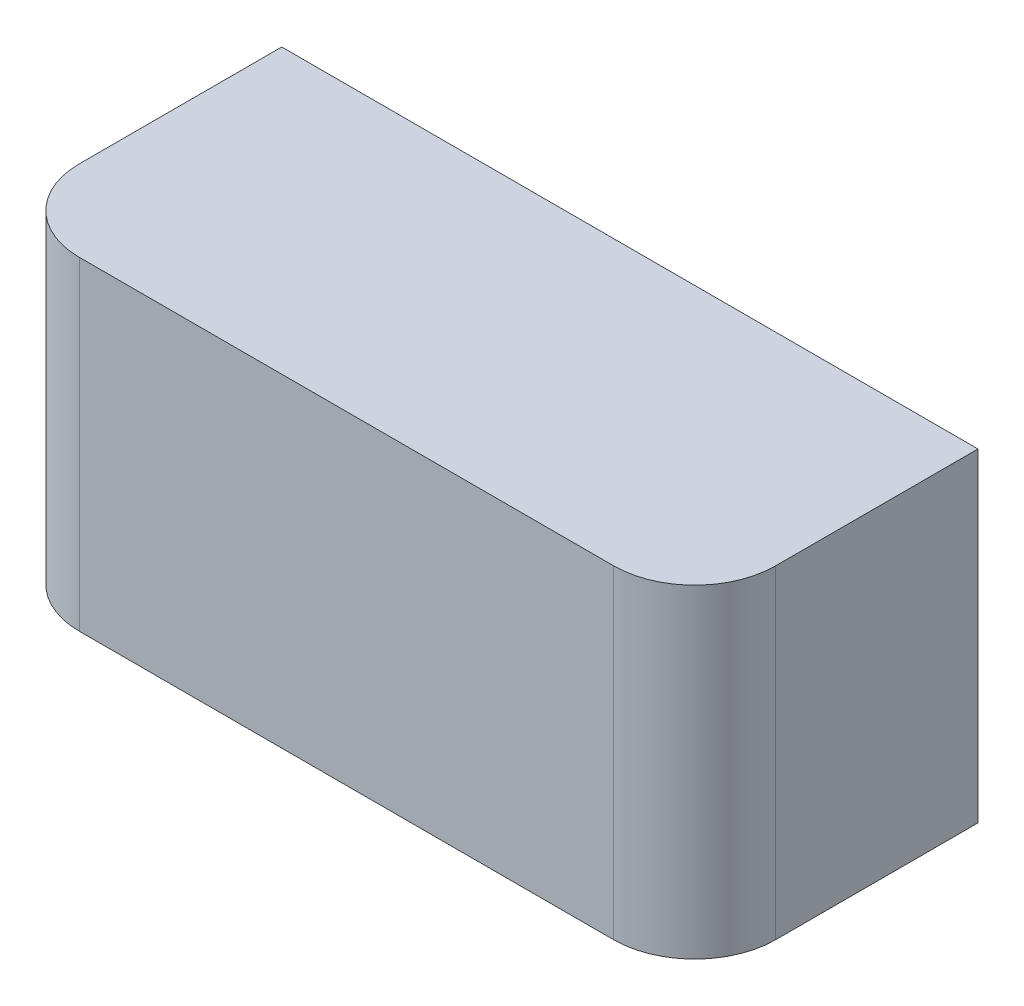
ISO-10303-21;
HEADER;
FILE_DESCRIPTION(('STEP AP214'),'2;1');
FILE_NAME('part.step','',(''),(''),'','','');
FILE_SCHEMA(('AUTOMOTIVE_DESIGN { 1 0 10303 214 1 1 1 1 }'));
ENDSEC;
DATA;
#1=APPLICATION_CONTEXT('core data for automotive mechanical design processes');
#2=APPLICATION_PROTOCOL_DEFINITION('international standard','automotive_design',2000,#1);
#3=PRODUCT_CONTEXT('',#1,'mechanical');
#4=PRODUCT('Part','Part','',(#3));
#5=PRODUCT_RELATED_PRODUCT_CATEGORY('part','',(#4));
#6=PRODUCT_DEFINITION_FORMATION('','',#4);
#7=PRODUCT_DEFINITION_CONTEXT('part definition',#1,'design');
#8=PRODUCT_DEFINITION('design','',#6,#7);
#9=PRODUCT_DEFINITION_SHAPE('','',#8);
#10=(LENGTH_UNIT() NAMED_UNIT(*) SI_UNIT(.MILLI.,.METRE.));
#11=(NAMED_UNIT(*) PLANE_ANGLE_UNIT() SI_UNIT($,.RADIAN.));
#12=(NAMED_UNIT(*) SI_UNIT($,.STERADIAN.) SOLID_ANGLE_UNIT());
#13=UNCERTAINTY_MEASURE_WITH_UNIT(LENGTH_MEASURE(1.E-05),#10,'distance_accuracy_value','');
#14=(GEOMETRIC_REPRESENTATION_CONTEXT(3) GLOBAL_UNCERTAINTY_ASSIGNED_CONTEXT((#13)) GLOBAL_UNIT_ASSIGNED_CONTEXT((#10,
#11,#12)) REPRESENTATION_CONTEXT('',''));
#15=CARTESIAN_POINT('',(0.,0.,0.));
#16=DIRECTION('',(0.,0.,1.));
#17=DIRECTION('',(1.,0.,0.));
#18=AXIS2_PLACEMENT_3D('',#15,#16,#17);
#19=CARTESIAN_POINT('',(-2.28,0.,-2.875));
#20=DIRECTION('',(0.,1.,0.));
#21=DIRECTION('',(0.,0.,1.));
#22=AXIS2_PLACEMENT_3D('',#19,#20,#21);
#23=CYLINDRICAL_SURFACE('',#22,0.05);
#24=DIRECTION('',(0.,1.,0.));
#25=VECTOR('',#24,1.);
#26=CARTESIAN_POINT('',(-2.33,0.,-2.875));
#27=LINE('',#26,#25);
#28=CARTESIAN_POINT('',(-2.33,0.,-2.875));
#29=VERTEX_POINT('',#28);
#30=CARTESIAN_POINT('',(-2.33,0.2,-2.875));
#31=VERTEX_POINT('',#30);
#32=EDGE_CURVE('E67',#29,#31,#27,.T.);
#33=ORIENTED_EDGE('',*,*,#32,.F.);
#34=CARTESIAN_POINT('',(-2.28,0.,-2.875));
#35=DIRECTION('',(0.,1.,0.));
#36=DIRECTION('',(0.,0.,1.));
#37=AXIS2_PLACEMENT_3D('',#34,#35,#36);
#38=CIRCLE('',#37,0.05);
#39=CARTESIAN_POINT('',(-2.28,0.,-2.825));
#40=VERTEX_POINT('',#39);
#41=EDGE_CURVE('E77',#29,#40,#38,.T.);
#42=ORIENTED_EDGE('',*,*,#41,.T.);
#43=DIRECTION('',(0.,1.,0.));
#44=VECTOR('',#43,1.);
#45=CARTESIAN_POINT('',(-2.28,0.,-2.825));
#46=LINE('',#45,#44);
#47=CARTESIAN_POINT('',(-2.28,0.2,-2.825));
#48=VERTEX_POINT('',#47);
#49=EDGE_CURVE('E72',#48,#40,#46,.F.);
#50=ORIENTED_EDGE('',*,*,#49,.F.);
#51=CARTESIAN_POINT('',(-2.28,0.2,-2.875));
#52=DIRECTION('',(0.,1.,0.));
#53=DIRECTION('',(0.,0.,1.));
#54=AXIS2_PLACEMENT_3D('',#51,#52,#53);
#55=CIRCLE('',#54,0.05);
#56=EDGE_CURVE('E20',#31,#48,#55,.T.);
#57=ORIENTED_EDGE('',*,*,#56,.F.);
#58=EDGE_LOOP('',(#33,#42,#50,#57));
#59=FACE_BOUND('',#58,.T.);
#60=ADVANCED_FACE('F17',(#59),#23,.T.);
#61=CARTESIAN_POINT('',(-2.28,0.,-2.825));
#62=DIRECTION('',(0.,0.,1.));
#63=DIRECTION('',(1.,0.,0.));
#64=AXIS2_PLACEMENT_3D('',#61,#62,#63);
#65=PLANE('',#64);
#66=ORIENTED_EDGE('',*,*,#49,.T.);
#67=DIRECTION('',(1.,0.,0.));
#68=VECTOR('',#67,1.);
#69=CARTESIAN_POINT('',(0.,0.,-2.825));
#70=LINE('',#69,#68);
#71=CARTESIAN_POINT('',(-1.95,0.,-2.825));
#72=VERTEX_POINT('',#71);
#73=EDGE_CURVE('E126',#40,#72,#70,.T.);
#74=ORIENTED_EDGE('',*,*,#73,.T.);
#75=DIRECTION('',(0.,1.,0.));
#76=VECTOR('',#75,1.);
#77=CARTESIAN_POINT('',(-1.95,0.,-2.825));
#78=LINE('',#77,#76);
#79=CARTESIAN_POINT('',(-1.95,0.2,-2.825));
#80=VERTEX_POINT('',#79);
#81=EDGE_CURVE('E80',#80,#72,#78,.F.);
#82=ORIENTED_EDGE('',*,*,#81,.F.);
#83=DIRECTION('',(1.,0.,0.));
#84=VECTOR('',#83,1.);
#85=CARTESIAN_POINT('',(0.,0.2,-2.825));
#86=LINE('',#85,#84);
#87=EDGE_CURVE('E83',#48,#80,#86,.T.);
#88=ORIENTED_EDGE('',*,*,#87,.F.);
#89=EDGE_LOOP('',(#66,#74,#82,#88));
#90=FACE_BOUND('',#89,.T.);
#91=ADVANCED_FACE('F84',(#90),#65,.T.);
#92=CARTESIAN_POINT('',(-1.95,0.,-2.875));
#93=DIRECTION('',(0.,1.,0.));
#94=DIRECTION('',(0.,0.,1.));
#95=AXIS2_PLACEMENT_3D('',#92,#93,#94);
#96=CYLINDRICAL_SURFACE('',#95,0.05);
#97=ORIENTED_EDGE('',*,*,#81,.T.);
#98=CARTESIAN_POINT('',(-1.95,0.,-2.875));
#99=DIRECTION('',(0.,1.,0.));
#100=DIRECTION('',(0.,0.,1.));
#101=AXIS2_PLACEMENT_3D('',#98,#99,#100);
#102=CIRCLE('',#101,0.05);
#103=CARTESIAN_POINT('',(-1.9,0.,-2.875));
#104=VERTEX_POINT('',#103);
#105=EDGE_CURVE('E124',#72,#104,#102,.T.);
#106=ORIENTED_EDGE('',*,*,#105,.T.);
#107=DIRECTION('',(0.,1.,0.));
#108=VECTOR('',#107,1.);
#109=CARTESIAN_POINT('',(-1.9,0.,-2.875));
#110=LINE('',#109,#108);
#111=CARTESIAN_POINT('',(-1.9,0.2,-2.875));
#112=VERTEX_POINT('',#111);
#113=EDGE_CURVE('E99',#112,#104,#110,.F.);
#114=ORIENTED_EDGE('',*,*,#113,.F.);
#115=CARTESIAN_POINT('',(-1.95,0.2,-2.875));
#116=DIRECTION('',(0.,1.,0.));
#117=DIRECTION('',(0.,0.,1.));
#118=AXIS2_PLACEMENT_3D('',#115,#116,#117);
#119=CIRCLE('',#118,0.05);
#120=EDGE_CURVE('E88',#80,#112,#119,.T.);
#121=ORIENTED_EDGE('',*,*,#120,.F.);
#122=EDGE_LOOP('',(#97,#106,#114,#121));
#123=FACE_BOUND('',#122,.T.);
#124=ADVANCED_FACE('F129',(#123),#96,.T.);
#125=CARTESIAN_POINT('',(-2.33,0.,-3.));
#126=DIRECTION('',(-1.,0.,0.));
#127=DIRECTION('',(0.,0.,1.));
#128=AXIS2_PLACEMENT_3D('',#125,#126,#127);
#129=PLANE('',#128);
#130=DIRECTION('',(0.,1.,0.));
#131=VECTOR('',#130,1.);
#132=CARTESIAN_POINT('',(-2.33,0.,-3.));
#133=LINE('',#132,#131);
#134=CARTESIAN_POINT('',(-2.33,0.,-3.));
#135=VERTEX_POINT('',#134);
#136=CARTESIAN_POINT('',(-2.33,0.2,-3.));
#137=VERTEX_POINT('',#136);
#138=EDGE_CURVE('E111',#135,#137,#133,.T.);
#139=ORIENTED_EDGE('',*,*,#138,.F.);
#140=DIRECTION('',(0.,0.,1.));
#141=VECTOR('',#140,1.);
#142=CARTESIAN_POINT('',(-2.33,0.,0.));
#143=LINE('',#142,#141);
#144=EDGE_CURVE('E100',#135,#29,#143,.T.);
#145=ORIENTED_EDGE('',*,*,#144,.T.);
#146=ORIENTED_EDGE('',*,*,#32,.T.);
#147=DIRECTION('',(0.,0.,1.));
#148=VECTOR('',#147,1.);
#149=CARTESIAN_POINT('',(-2.33,0.2,0.));
#150=LINE('',#149,#148);
#151=EDGE_CURVE('E92',#137,#31,#150,.T.);
#152=ORIENTED_EDGE('',*,*,#151,.F.);
#153=EDGE_LOOP('',(#139,#145,#146,#152));
#154=FACE_BOUND('',#153,.T.);
#155=ADVANCED_FACE('F135',(#154),#129,.T.);
#156=CARTESIAN_POINT('',(0.,0.2,0.));
#157=DIRECTION('',(0.,1.,0.));
#158=DIRECTION('',(0.,0.,1.));
#159=AXIS2_PLACEMENT_3D('',#156,#157,#158);
#160=PLANE('',#159);
#161=DIRECTION('',(0.,0.,-1.));
#162=VECTOR('',#161,1.);
#163=CARTESIAN_POINT('',(-1.9,0.2,-2.875));
#164=LINE('',#163,#162);
#165=CARTESIAN_POINT('',(-1.9,0.2,-3.));
#166=VERTEX_POINT('',#165);
#167=EDGE_CURVE('E101',#166,#112,#164,.F.);
#168=ORIENTED_EDGE('',*,*,#167,.F.);
#169=DIRECTION('',(-1.,0.,0.));
#170=VECTOR('',#169,1.);
#171=CARTESIAN_POINT('',(-1.9,0.2,-3.));
#172=LINE('',#171,#170);
#173=EDGE_CURVE('E107',#137,#166,#172,.F.);
#174=ORIENTED_EDGE('',*,*,#173,.F.);
#175=ORIENTED_EDGE('',*,*,#151,.T.);
#176=ORIENTED_EDGE('',*,*,#56,.T.);
#177=ORIENTED_EDGE('',*,*,#87,.T.);
#178=ORIENTED_EDGE('',*,*,#120,.T.);
#179=EDGE_LOOP('',(#168,#174,#175,#176,#177,#178));
#180=FACE_BOUND('',#179,.T.);
#181=ADVANCED_FACE('F90',(#180),#160,.T.);
#182=CARTESIAN_POINT('',(-1.9,0.,-2.875));
#183=DIRECTION('',(1.,0.,0.));
#184=DIRECTION('',(0.,0.,-1.));
#185=AXIS2_PLACEMENT_3D('',#182,#183,#184);
#186=PLANE('',#185);
#187=ORIENTED_EDGE('',*,*,#113,.T.);
#188=DIRECTION('',(0.,0.,1.));
#189=VECTOR('',#188,1.);
#190=CARTESIAN_POINT('',(-1.9,0.,0.));
#191=LINE('',#190,#189);
#192=CARTESIAN_POINT('',(-1.9,0.,-3.));
#193=VERTEX_POINT('',#192);
#194=EDGE_CURVE('E35',#104,#193,#191,.F.);
#195=ORIENTED_EDGE('',*,*,#194,.T.);
#196=DIRECTION('',(0.,1.,0.));
#197=VECTOR('',#196,1.);
#198=CARTESIAN_POINT('',(-1.9,0.,-3.));
#199=LINE('',#198,#197);
#200=EDGE_CURVE('E26',#166,#193,#199,.F.);
#201=ORIENTED_EDGE('',*,*,#200,.F.);
#202=ORIENTED_EDGE('',*,*,#167,.T.);
#203=EDGE_LOOP('',(#187,#195,#201,#202));
#204=FACE_BOUND('',#203,.T.);
#205=ADVANCED_FACE('F131',(#204),#186,.T.);
#206=CARTESIAN_POINT('',(0.,0.,0.));
#207=DIRECTION('',(0.,1.,0.));
#208=DIRECTION('',(0.,0.,1.));
#209=AXIS2_PLACEMENT_3D('',#206,#207,#208);
#210=PLANE('',#209);
#211=ORIENTED_EDGE('',*,*,#105,.F.);
#212=ORIENTED_EDGE('',*,*,#73,.F.);
#213=ORIENTED_EDGE('',*,*,#41,.F.);
#214=ORIENTED_EDGE('',*,*,#144,.F.);
#215=DIRECTION('',(-1.,0.,0.));
#216=VECTOR('',#215,1.);
#217=CARTESIAN_POINT('',(-1.9,0.,-3.));
#218=LINE('',#217,#216);
#219=EDGE_CURVE('E11',#193,#135,#218,.T.);
#220=ORIENTED_EDGE('',*,*,#219,.F.);
#221=ORIENTED_EDGE('',*,*,#194,.F.);
#222=EDGE_LOOP('',(#211,#212,#213,#214,#220,#221));
#223=FACE_BOUND('',#222,.T.);
#224=ADVANCED_FACE('F137',(#223),#210,.F.);
#225=CARTESIAN_POINT('',(-1.9,0.,-3.));
#226=DIRECTION('',(0.,0.,-1.));
#227=DIRECTION('',(-1.,0.,0.));
#228=AXIS2_PLACEMENT_3D('',#225,#226,#227);
#229=PLANE('',#228);
#230=ORIENTED_EDGE('',*,*,#200,.T.);
#231=ORIENTED_EDGE('',*,*,#219,.T.);
#232=ORIENTED_EDGE('',*,*,#138,.T.);
#233=ORIENTED_EDGE('',*,*,#173,.T.);
#234=EDGE_LOOP('',(#230,#231,#232,#233));
#235=FACE_BOUND('',#234,.T.);
#236=ADVANCED_FACE('F133',(#235),#229,.T.);
#237=CLOSED_SHELL('',(#60,#91,#124,#155,#181,#205,#224,#236));
#238=MANIFOLD_SOLID_BREP('B1',#237);
#239=ADVANCED_BREP_SHAPE_REPRESENTATION('',(#18,#238),#14);
#240=SHAPE_DEFINITION_REPRESENTATION(#9,#239);
ENDSEC;
END-ISO-10303-21;
